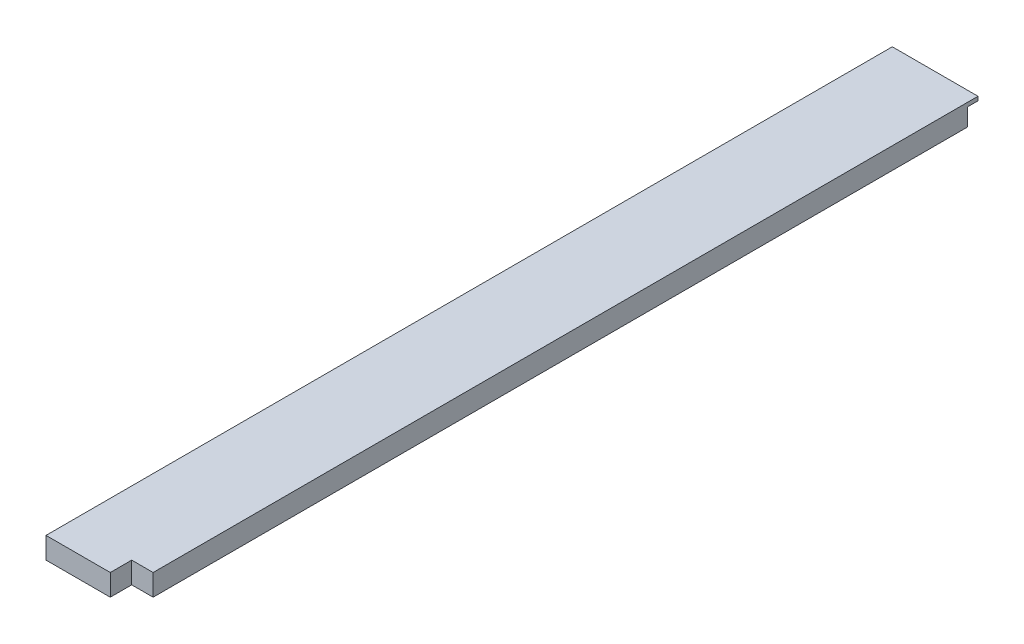
ISO-10303-21;
HEADER;
FILE_DESCRIPTION(('STEP AP214'),'2;1');
FILE_NAME('part.step','',(''),(''),'','','');
FILE_SCHEMA(('AUTOMOTIVE_DESIGN { 1 0 10303 214 1 1 1 1 }'));
ENDSEC;
DATA;
#1=APPLICATION_CONTEXT('core data for automotive mechanical design processes');
#2=APPLICATION_PROTOCOL_DEFINITION('international standard','automotive_design',2000,#1);
#3=PRODUCT_CONTEXT('',#1,'mechanical');
#4=PRODUCT('Part','Part','',(#3));
#5=PRODUCT_RELATED_PRODUCT_CATEGORY('part','',(#4));
#6=PRODUCT_DEFINITION_FORMATION('','',#4);
#7=PRODUCT_DEFINITION_CONTEXT('part definition',#1,'design');
#8=PRODUCT_DEFINITION('design','',#6,#7);
#9=PRODUCT_DEFINITION_SHAPE('','',#8);
#10=(LENGTH_UNIT() NAMED_UNIT(*) SI_UNIT(.MILLI.,.METRE.));
#11=(NAMED_UNIT(*) PLANE_ANGLE_UNIT() SI_UNIT($,.RADIAN.));
#12=(NAMED_UNIT(*) SI_UNIT($,.STERADIAN.) SOLID_ANGLE_UNIT());
#13=UNCERTAINTY_MEASURE_WITH_UNIT(LENGTH_MEASURE(1.E-05),#10,'distance_accuracy_value','');
#14=(GEOMETRIC_REPRESENTATION_CONTEXT(3) GLOBAL_UNCERTAINTY_ASSIGNED_CONTEXT((#13)) GLOBAL_UNIT_ASSIGNED_CONTEXT((#10,
#11,#12)) REPRESENTATION_CONTEXT('',''));
#15=CARTESIAN_POINT('',(0.,0.,0.));
#16=DIRECTION('',(0.,0.,1.));
#17=DIRECTION('',(1.,0.,0.));
#18=AXIS2_PLACEMENT_3D('',#15,#16,#17);
#19=CARTESIAN_POINT('',(0.,0.,501.65));
#20=DIRECTION('',(1.,0.,0.));
#21=DIRECTION('',(0.,0.,-1.));
#22=AXIS2_PLACEMENT_3D('',#19,#20,#21);
#23=PLANE('',#22);
#24=DIRECTION('',(0.,-1.,0.));
#25=VECTOR('',#24,1.);
#26=CARTESIAN_POINT('',(0.,10.3378,6.35));
#27=LINE('',#26,#25);
#28=CARTESIAN_POINT('',(0.,10.3378,6.35));
#29=VERTEX_POINT('',#28);
#30=CARTESIAN_POINT('',(0.,0.,6.35));
#31=VERTEX_POINT('',#30);
#32=EDGE_CURVE('E138',#29,#31,#27,.T.);
#33=ORIENTED_EDGE('',*,*,#32,.T.);
#34=DIRECTION('',(0.,0.,-1.));
#35=VECTOR('',#34,1.);
#36=CARTESIAN_POINT('',(0.,0.,501.65));
#37=LINE('',#36,#35);
#38=CARTESIAN_POINT('',(0.,0.,501.65));
#39=VERTEX_POINT('',#38);
#40=EDGE_CURVE('E11',#39,#31,#37,.T.);
#41=ORIENTED_EDGE('',*,*,#40,.F.);
#42=DIRECTION('',(0.,-1.,0.));
#43=VECTOR('',#42,1.);
#44=CARTESIAN_POINT('',(0.,0.,501.65));
#45=LINE('',#44,#43);
#46=CARTESIAN_POINT('',(0.,12.7,501.65));
#47=VERTEX_POINT('',#46);
#48=EDGE_CURVE('E142',#47,#39,#45,.T.);
#49=ORIENTED_EDGE('',*,*,#48,.F.);
#50=DIRECTION('',(0.,0.,-1.));
#51=VECTOR('',#50,1.);
#52=CARTESIAN_POINT('',(0.,12.7,501.65));
#53=LINE('',#52,#51);
#54=CARTESIAN_POINT('',(0.,12.7,0.));
#55=VERTEX_POINT('',#54);
#56=EDGE_CURVE('E150',#47,#55,#53,.T.);
#57=ORIENTED_EDGE('',*,*,#56,.T.);
#58=DIRECTION('',(0.,-1.,0.));
#59=VECTOR('',#58,1.);
#60=CARTESIAN_POINT('',(0.,0.,0.));
#61=LINE('',#60,#59);
#62=CARTESIAN_POINT('',(0.,10.3378,0.));
#63=VERTEX_POINT('',#62);
#64=EDGE_CURVE('E141',#55,#63,#61,.T.);
#65=ORIENTED_EDGE('',*,*,#64,.T.);
#66=DIRECTION('',(0.,0.,1.));
#67=VECTOR('',#66,1.);
#68=CARTESIAN_POINT('',(0.,10.3378,6.35));
#69=LINE('',#68,#67);
#70=EDGE_CURVE('E56',#63,#29,#69,.T.);
#71=ORIENTED_EDGE('',*,*,#70,.T.);
#72=EDGE_LOOP('',(#33,#41,#49,#57,#65,#71));
#73=FACE_BOUND('',#72,.T.);
#74=ADVANCED_FACE('F34',(#73),#23,.F.);
#75=CARTESIAN_POINT('',(50.8,0.,501.65));
#76=DIRECTION('',(0.,1.,0.));
#77=DIRECTION('',(-1.,0.,0.));
#78=AXIS2_PLACEMENT_3D('',#75,#76,#77);
#79=PLANE('',#78);
#80=DIRECTION('',(0.,0.,-1.));
#81=VECTOR('',#80,1.);
#82=CARTESIAN_POINT('',(50.8,0.,501.65));
#83=LINE('',#82,#81);
#84=CARTESIAN_POINT('',(50.8,0.,488.95));
#85=VERTEX_POINT('',#84);
#86=CARTESIAN_POINT('',(50.8,0.,6.35));
#87=VERTEX_POINT('',#86);
#88=EDGE_CURVE('E41',#85,#87,#83,.T.);
#89=ORIENTED_EDGE('',*,*,#88,.F.);
#90=DIRECTION('',(1.,0.,0.));
#91=VECTOR('',#90,1.);
#92=CARTESIAN_POINT('',(50.8,0.,488.95));
#93=LINE('',#92,#91);
#94=CARTESIAN_POINT('',(38.1,0.,488.95));
#95=VERTEX_POINT('',#94);
#96=EDGE_CURVE('E117',#95,#85,#93,.T.);
#97=ORIENTED_EDGE('',*,*,#96,.F.);
#98=DIRECTION('',(0.,0.,-1.));
#99=VECTOR('',#98,1.);
#100=CARTESIAN_POINT('',(38.1,0.,501.65));
#101=LINE('',#100,#99);
#102=CARTESIAN_POINT('',(38.1,0.,501.65));
#103=VERTEX_POINT('',#102);
#104=EDGE_CURVE('E100',#103,#95,#101,.T.);
#105=ORIENTED_EDGE('',*,*,#104,.F.);
#106=DIRECTION('',(1.,0.,0.));
#107=VECTOR('',#106,1.);
#108=CARTESIAN_POINT('',(50.8,0.,501.65));
#109=LINE('',#108,#107);
#110=EDGE_CURVE('E145',#39,#103,#109,.T.);
#111=ORIENTED_EDGE('',*,*,#110,.F.);
#112=ORIENTED_EDGE('',*,*,#40,.T.);
#113=DIRECTION('',(1.,0.,0.));
#114=VECTOR('',#113,1.);
#115=CARTESIAN_POINT('',(0.,0.,6.35));
#116=LINE('',#115,#114);
#117=EDGE_CURVE('E122',#31,#87,#116,.T.);
#118=ORIENTED_EDGE('',*,*,#117,.T.);
#119=EDGE_LOOP('',(#89,#97,#105,#111,#112,#118));
#120=FACE_BOUND('',#119,.T.);
#121=ADVANCED_FACE('F169',(#120),#79,.F.);
#122=CARTESIAN_POINT('',(50.8,6.35,501.65));
#123=DIRECTION('',(-1.,0.,0.));
#124=DIRECTION('',(0.,0.,1.));
#125=AXIS2_PLACEMENT_3D('',#122,#123,#124);
#126=PLANE('',#125);
#127=DIRECTION('',(0.,0.,-1.));
#128=VECTOR('',#127,1.);
#129=CARTESIAN_POINT('',(50.8,12.7,501.65));
#130=LINE('',#129,#128);
#131=CARTESIAN_POINT('',(50.8,12.7,488.95));
#132=VERTEX_POINT('',#131);
#133=CARTESIAN_POINT('',(50.8,12.7,0.));
#134=VERTEX_POINT('',#133);
#135=EDGE_CURVE('E159',#132,#134,#130,.T.);
#136=ORIENTED_EDGE('',*,*,#135,.F.);
#137=DIRECTION('',(0.,-1.,0.));
#138=VECTOR('',#137,1.);
#139=CARTESIAN_POINT('',(50.8,12.7,488.95));
#140=LINE('',#139,#138);
#141=EDGE_CURVE('E103',#132,#85,#140,.T.);
#142=ORIENTED_EDGE('',*,*,#141,.T.);
#143=ORIENTED_EDGE('',*,*,#88,.T.);
#144=DIRECTION('',(0.,-1.,0.));
#145=VECTOR('',#144,1.);
#146=CARTESIAN_POINT('',(50.8,10.3378,6.35));
#147=LINE('',#146,#145);
#148=CARTESIAN_POINT('',(50.8,10.3378,6.35));
#149=VERTEX_POINT('',#148);
#150=EDGE_CURVE('E133',#149,#87,#147,.T.);
#151=ORIENTED_EDGE('',*,*,#150,.F.);
#152=DIRECTION('',(0.,0.,-1.));
#153=VECTOR('',#152,1.);
#154=CARTESIAN_POINT('',(50.8,10.3378,6.35));
#155=LINE('',#154,#153);
#156=CARTESIAN_POINT('',(50.8,10.3378,0.));
#157=VERTEX_POINT('',#156);
#158=EDGE_CURVE('E128',#149,#157,#155,.T.);
#159=ORIENTED_EDGE('',*,*,#158,.T.);
#160=DIRECTION('',(0.,1.,0.));
#161=VECTOR('',#160,1.);
#162=CARTESIAN_POINT('',(50.8,6.35,0.));
#163=LINE('',#162,#161);
#164=EDGE_CURVE('E153',#157,#134,#163,.T.);
#165=ORIENTED_EDGE('',*,*,#164,.T.);
#166=EDGE_LOOP('',(#136,#142,#143,#151,#159,#165));
#167=FACE_BOUND('',#166,.T.);
#168=ADVANCED_FACE('F163',(#167),#126,.F.);
#169=CARTESIAN_POINT('',(0.,0.,0.));
#170=DIRECTION('',(0.,0.,-1.));
#171=DIRECTION('',(-1.,0.,0.));
#172=AXIS2_PLACEMENT_3D('',#169,#170,#171);
#173=PLANE('',#172);
#174=ORIENTED_EDGE('',*,*,#164,.F.);
#175=DIRECTION('',(-1.,0.,0.));
#176=VECTOR('',#175,1.);
#177=CARTESIAN_POINT('',(0.,10.3378,0.));
#178=LINE('',#177,#176);
#179=EDGE_CURVE('E131',#157,#63,#178,.T.);
#180=ORIENTED_EDGE('',*,*,#179,.T.);
#181=ORIENTED_EDGE('',*,*,#64,.F.);
#182=DIRECTION('',(-1.,0.,0.));
#183=VECTOR('',#182,1.);
#184=CARTESIAN_POINT('',(0.,12.7,0.));
#185=LINE('',#184,#183);
#186=EDGE_CURVE('E146',#134,#55,#185,.T.);
#187=ORIENTED_EDGE('',*,*,#186,.F.);
#188=EDGE_LOOP('',(#174,#180,#181,#187));
#189=FACE_BOUND('',#188,.T.);
#190=ADVANCED_FACE('F177',(#189),#173,.T.);
#191=CARTESIAN_POINT('',(0.,12.7,501.65));
#192=DIRECTION('',(0.,-1.,0.));
#193=DIRECTION('',(0.,0.,-1.));
#194=AXIS2_PLACEMENT_3D('',#191,#192,#193);
#195=PLANE('',#194);
#196=DIRECTION('',(0.,0.,-1.));
#197=VECTOR('',#196,1.);
#198=CARTESIAN_POINT('',(38.1,12.7,501.65));
#199=LINE('',#198,#197);
#200=CARTESIAN_POINT('',(38.1,12.7,501.65));
#201=VERTEX_POINT('',#200);
#202=CARTESIAN_POINT('',(38.1,12.7,488.95));
#203=VERTEX_POINT('',#202);
#204=EDGE_CURVE('E48',#201,#203,#199,.T.);
#205=ORIENTED_EDGE('',*,*,#204,.T.);
#206=DIRECTION('',(1.,0.,0.));
#207=VECTOR('',#206,1.);
#208=CARTESIAN_POINT('',(50.8,12.7,488.95));
#209=LINE('',#208,#207);
#210=EDGE_CURVE('E107',#203,#132,#209,.T.);
#211=ORIENTED_EDGE('',*,*,#210,.T.);
#212=ORIENTED_EDGE('',*,*,#135,.T.);
#213=ORIENTED_EDGE('',*,*,#186,.T.);
#214=ORIENTED_EDGE('',*,*,#56,.F.);
#215=DIRECTION('',(-1.,0.,0.));
#216=VECTOR('',#215,1.);
#217=CARTESIAN_POINT('',(50.8,12.7,501.65));
#218=LINE('',#217,#216);
#219=EDGE_CURVE('E116',#201,#47,#218,.T.);
#220=ORIENTED_EDGE('',*,*,#219,.F.);
#221=EDGE_LOOP('',(#205,#211,#212,#213,#214,#220));
#222=FACE_BOUND('',#221,.T.);
#223=ADVANCED_FACE('F114',(#222),#195,.F.);
#224=CARTESIAN_POINT('',(0.,0.,501.65));
#225=DIRECTION('',(0.,0.,-1.));
#226=DIRECTION('',(-1.,0.,0.));
#227=AXIS2_PLACEMENT_3D('',#224,#225,#226);
#228=PLANE('',#227);
#229=ORIENTED_EDGE('',*,*,#110,.T.);
#230=DIRECTION('',(0.,-1.,0.));
#231=VECTOR('',#230,1.);
#232=CARTESIAN_POINT('',(38.1,12.7,501.65));
#233=LINE('',#232,#231);
#234=EDGE_CURVE('E104',#201,#103,#233,.T.);
#235=ORIENTED_EDGE('',*,*,#234,.F.);
#236=ORIENTED_EDGE('',*,*,#219,.T.);
#237=ORIENTED_EDGE('',*,*,#48,.T.);
#238=EDGE_LOOP('',(#229,#235,#236,#237));
#239=FACE_BOUND('',#238,.T.);
#240=ADVANCED_FACE('F186',(#239),#228,.F.);
#241=CARTESIAN_POINT('',(0.,10.3378,6.35));
#242=DIRECTION('',(0.,0.,-1.));
#243=DIRECTION('',(-1.,0.,0.));
#244=AXIS2_PLACEMENT_3D('',#241,#242,#243);
#245=PLANE('',#244);
#246=ORIENTED_EDGE('',*,*,#117,.F.);
#247=ORIENTED_EDGE('',*,*,#32,.F.);
#248=DIRECTION('',(1.,0.,0.));
#249=VECTOR('',#248,1.);
#250=CARTESIAN_POINT('',(0.,10.3378,6.35));
#251=LINE('',#250,#249);
#252=EDGE_CURVE('E126',#29,#149,#251,.T.);
#253=ORIENTED_EDGE('',*,*,#252,.T.);
#254=ORIENTED_EDGE('',*,*,#150,.T.);
#255=EDGE_LOOP('',(#246,#247,#253,#254));
#256=FACE_BOUND('',#255,.T.);
#257=ADVANCED_FACE('F166',(#256),#245,.T.);
#258=CARTESIAN_POINT('',(0.,10.3378,0.));
#259=DIRECTION('',(0.,-1.,0.));
#260=DIRECTION('',(1.,0.,0.));
#261=AXIS2_PLACEMENT_3D('',#258,#259,#260);
#262=PLANE('',#261);
#263=ORIENTED_EDGE('',*,*,#70,.F.);
#264=ORIENTED_EDGE('',*,*,#179,.F.);
#265=ORIENTED_EDGE('',*,*,#158,.F.);
#266=ORIENTED_EDGE('',*,*,#252,.F.);
#267=EDGE_LOOP('',(#263,#264,#265,#266));
#268=FACE_BOUND('',#267,.T.);
#269=ADVANCED_FACE('F178',(#268),#262,.T.);
#270=CARTESIAN_POINT('',(50.8,12.7,488.95));
#271=DIRECTION('',(0.,0.,-1.));
#272=DIRECTION('',(-1.,0.,0.));
#273=AXIS2_PLACEMENT_3D('',#270,#271,#272);
#274=PLANE('',#273);
#275=ORIENTED_EDGE('',*,*,#96,.T.);
#276=ORIENTED_EDGE('',*,*,#141,.F.);
#277=ORIENTED_EDGE('',*,*,#210,.F.);
#278=DIRECTION('',(0.,-1.,0.));
#279=VECTOR('',#278,1.);
#280=CARTESIAN_POINT('',(38.1,12.7,488.95));
#281=LINE('',#280,#279);
#282=EDGE_CURVE('E96',#203,#95,#281,.T.);
#283=ORIENTED_EDGE('',*,*,#282,.T.);
#284=EDGE_LOOP('',(#275,#276,#277,#283));
#285=FACE_BOUND('',#284,.T.);
#286=ADVANCED_FACE('F108',(#285),#274,.F.);
#287=CARTESIAN_POINT('',(38.1,12.7,501.65));
#288=DIRECTION('',(-1.,0.,0.));
#289=DIRECTION('',(0.,-1.,0.));
#290=AXIS2_PLACEMENT_3D('',#287,#288,#289);
#291=PLANE('',#290);
#292=ORIENTED_EDGE('',*,*,#104,.T.);
#293=ORIENTED_EDGE('',*,*,#282,.F.);
#294=ORIENTED_EDGE('',*,*,#204,.F.);
#295=ORIENTED_EDGE('',*,*,#234,.T.);
#296=EDGE_LOOP('',(#292,#293,#294,#295));
#297=FACE_BOUND('',#296,.T.);
#298=ADVANCED_FACE('F98',(#297),#291,.F.);
#299=CLOSED_SHELL('',(#74,#121,#168,#190,#223,#240,#257,#269,#286,#298));
#300=MANIFOLD_SOLID_BREP('B2',#299);
#301=ADVANCED_BREP_SHAPE_REPRESENTATION('',(#18,#300),#14);
#302=SHAPE_DEFINITION_REPRESENTATION(#9,#301);
ENDSEC;
END-ISO-10303-21;
